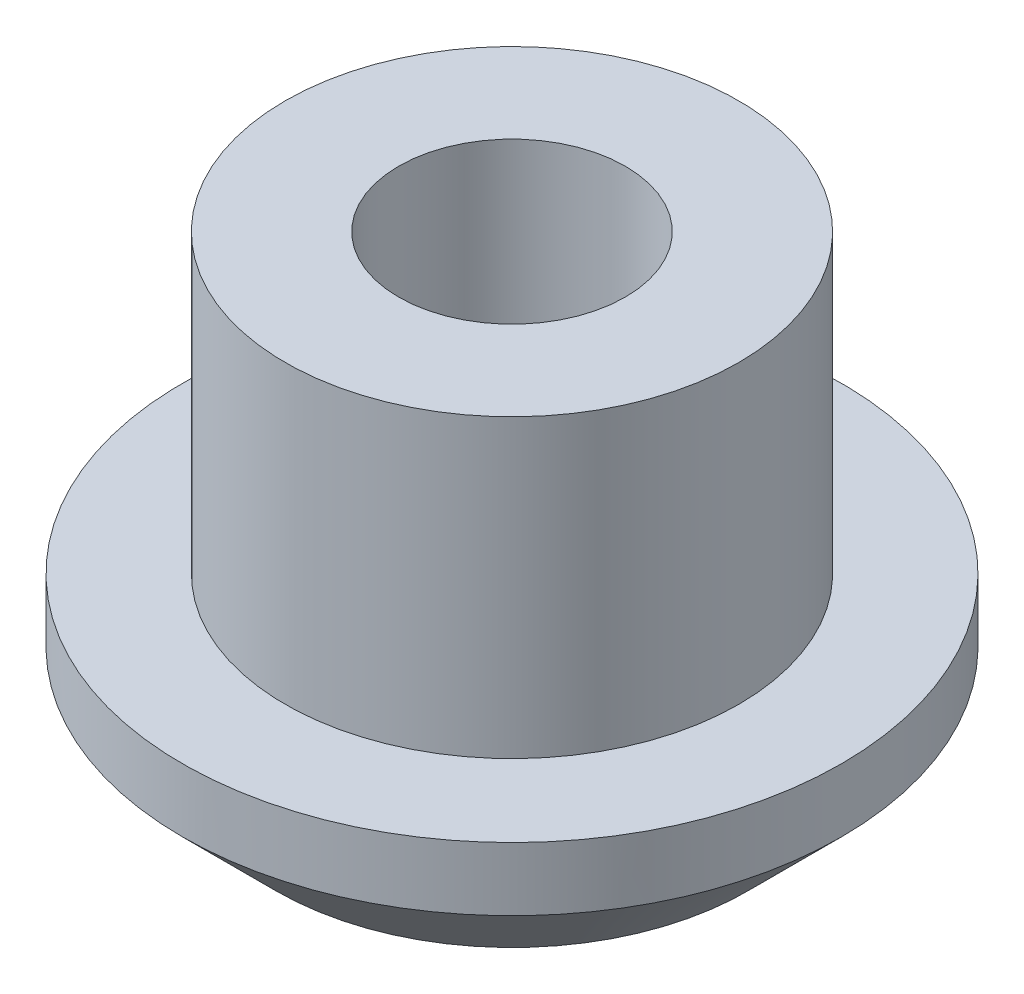
ISO-10303-21;
HEADER;
FILE_DESCRIPTION(('STEP AP214'),'2;1');
FILE_NAME('part.step','',(''),(''),'','','');
FILE_SCHEMA(('AUTOMOTIVE_DESIGN { 1 0 10303 214 1 1 1 1 }'));
ENDSEC;
DATA;
#1=APPLICATION_CONTEXT('core data for automotive mechanical design processes');
#2=APPLICATION_PROTOCOL_DEFINITION('international standard','automotive_design',2000,#1);
#3=PRODUCT_CONTEXT('',#1,'mechanical');
#4=PRODUCT('Part','Part','',(#3));
#5=PRODUCT_RELATED_PRODUCT_CATEGORY('part','',(#4));
#6=PRODUCT_DEFINITION_FORMATION('','',#4);
#7=PRODUCT_DEFINITION_CONTEXT('part definition',#1,'design');
#8=PRODUCT_DEFINITION('design','',#6,#7);
#9=PRODUCT_DEFINITION_SHAPE('','',#8);
#10=(LENGTH_UNIT() NAMED_UNIT(*) SI_UNIT(.MILLI.,.METRE.));
#11=(NAMED_UNIT(*) PLANE_ANGLE_UNIT() SI_UNIT($,.RADIAN.));
#12=(NAMED_UNIT(*) SI_UNIT($,.STERADIAN.) SOLID_ANGLE_UNIT());
#13=UNCERTAINTY_MEASURE_WITH_UNIT(LENGTH_MEASURE(1.E-05),#10,'distance_accuracy_value','');
#14=(GEOMETRIC_REPRESENTATION_CONTEXT(3) GLOBAL_UNCERTAINTY_ASSIGNED_CONTEXT((#13)) GLOBAL_UNIT_ASSIGNED_CONTEXT((#10,
#11,#12)) REPRESENTATION_CONTEXT('',''));
#15=CARTESIAN_POINT('',(0.,0.,0.));
#16=DIRECTION('',(0.,0.,1.));
#17=DIRECTION('',(1.,0.,0.));
#18=AXIS2_PLACEMENT_3D('',#15,#16,#17);
#19=CARTESIAN_POINT('',(2.25638341944507,3.95131269504348,0.));
#20=DIRECTION('',(0.,1.,0.));
#21=DIRECTION('',(0.,0.,1.));
#22=AXIS2_PLACEMENT_3D('',#19,#20,#21);
#23=CONICAL_SURFACE('',#22,13.842999998227,0.7853981625);
#24=CARTESIAN_POINT('',(2.25638341944507,3.95131269327044,0.));
#25=DIRECTION('',(0.,-1.,0.));
#26=DIRECTION('',(1.,0.,0.));
#27=AXIS2_PLACEMENT_3D('',#24,#25,#26);
#28=CIRCLE('',#27,13.843);
#29=CARTESIAN_POINT('',(16.0993834194451,3.95131269327044,0.));
#30=VERTEX_POINT('',#29);
#31=EDGE_CURVE('E39',#30,#30,#28,.F.);
#32=ORIENTED_EDGE('',*,*,#31,.F.);
#33=EDGE_LOOP('',(#32));
#34=FACE_BOUND('',#33,.T.);
#35=CARTESIAN_POINT('',(2.25638341944507,-1.7730495890933E-09,0.));
#36=DIRECTION('',(0.,1.,0.));
#37=DIRECTION('',(0.,0.,1.));
#38=AXIS2_PLACEMENT_3D('',#35,#36,#37);
#39=CIRCLE('',#38,9.89168730850263);
#40=CARTESIAN_POINT('',(2.25638341944507,-1.7730495890933E-09,9.89168730850263));
#41=VERTEX_POINT('',#40);
#42=EDGE_CURVE('E18',#41,#41,#39,.F.);
#43=ORIENTED_EDGE('',*,*,#42,.F.);
#44=EDGE_LOOP('',(#43));
#45=FACE_BOUND('',#44,.T.);
#46=ADVANCED_FACE('F15',(#34,#45),#23,.T.);
#47=CARTESIAN_POINT('',(7.20222707280986,0.,0.));
#48=DIRECTION('',(0.,-1.,0.));
#49=DIRECTION('',(0.,0.,-1.));
#50=AXIS2_PLACEMENT_3D('',#47,#48,#49);
#51=PLANE('',#50);
#52=CARTESIAN_POINT('',(2.25638341944507,0.,0.));
#53=DIRECTION('',(0.,1.,0.));
#54=DIRECTION('',(-1.,0.,0.));
#55=AXIS2_PLACEMENT_3D('',#52,#53,#54);
#56=CIRCLE('',#55,4.7625);
#57=CARTESIAN_POINT('',(-2.50611658055493,0.,0.));
#58=VERTEX_POINT('',#57);
#59=EDGE_CURVE('E37',#58,#58,#56,.T.);
#60=ORIENTED_EDGE('',*,*,#59,.T.);
#61=EDGE_LOOP('',(#60));
#62=FACE_BOUND('',#61,.T.);
#63=ORIENTED_EDGE('',*,*,#42,.T.);
#64=EDGE_LOOP('',(#63));
#65=FACE_BOUND('',#64,.T.);
#66=ADVANCED_FACE('F48',(#62,#65),#51,.T.);
#67=CARTESIAN_POINT('',(2.25638341944507,5.28226923556506,0.));
#68=DIRECTION('',(0.,-1.,0.));
#69=DIRECTION('',(1.,0.,0.));
#70=AXIS2_PLACEMENT_3D('',#67,#68,#69);
#71=CYLINDRICAL_SURFACE('',#70,13.843);
#72=CARTESIAN_POINT('',(2.25638341944507,6.61322577785969,0.));
#73=DIRECTION('',(0.,-1.,0.));
#74=DIRECTION('',(1.,0.,0.));
#75=AXIS2_PLACEMENT_3D('',#72,#73,#74);
#76=CIRCLE('',#75,13.843);
#77=CARTESIAN_POINT('',(16.0993834194451,6.61322577785969,0.));
#78=VERTEX_POINT('',#77);
#79=EDGE_CURVE('E35',#78,#78,#76,.F.);
#80=ORIENTED_EDGE('',*,*,#79,.F.);
#81=EDGE_LOOP('',(#80));
#82=FACE_BOUND('',#81,.T.);
#83=ORIENTED_EDGE('',*,*,#31,.T.);
#84=EDGE_LOOP('',(#83));
#85=FACE_BOUND('',#84,.T.);
#86=ADVANCED_FACE('F56',(#82,#85),#71,.T.);
#87=CARTESIAN_POINT('',(2.25638341944507,-24.4922977345018,0.));
#88=DIRECTION('',(0.,1.,0.));
#89=DIRECTION('',(-1.,0.,0.));
#90=AXIS2_PLACEMENT_3D('',#87,#88,#89);
#91=CYLINDRICAL_SURFACE('',#90,4.7625);
#92=CARTESIAN_POINT('',(2.25638341944507,19.05,0.));
#93=DIRECTION('',(0.,1.,0.));
#94=DIRECTION('',(-1.,0.,0.));
#95=AXIS2_PLACEMENT_3D('',#92,#93,#94);
#96=CIRCLE('',#95,4.7625);
#97=CARTESIAN_POINT('',(-2.50611658055493,19.05,0.));
#98=VERTEX_POINT('',#97);
#99=EDGE_CURVE('E27',#98,#98,#96,.F.);
#100=ORIENTED_EDGE('',*,*,#99,.F.);
#101=EDGE_LOOP('',(#100));
#102=FACE_BOUND('',#101,.T.);
#103=ORIENTED_EDGE('',*,*,#59,.F.);
#104=EDGE_LOOP('',(#103));
#105=FACE_BOUND('',#104,.T.);
#106=ADVANCED_FACE('F71',(#102,#105),#91,.F.);
#107=CARTESIAN_POINT('',(13.9403834194451,6.61322577785969,0.));
#108=DIRECTION('',(0.,1.,0.));
#109=DIRECTION('',(0.,0.,1.));
#110=AXIS2_PLACEMENT_3D('',#107,#108,#109);
#111=PLANE('',#110);
#112=CARTESIAN_POINT('',(2.25638341944507,6.61322577785969,0.));
#113=DIRECTION('',(0.,-1.,0.));
#114=DIRECTION('',(1.,0.,0.));
#115=AXIS2_PLACEMENT_3D('',#112,#113,#114);
#116=CIRCLE('',#115,9.525);
#117=CARTESIAN_POINT('',(11.7813834194451,6.61322577785969,0.));
#118=VERTEX_POINT('',#117);
#119=EDGE_CURVE('E22',#118,#118,#116,.F.);
#120=ORIENTED_EDGE('',*,*,#119,.F.);
#121=EDGE_LOOP('',(#120));
#122=FACE_BOUND('',#121,.T.);
#123=ORIENTED_EDGE('',*,*,#79,.T.);
#124=EDGE_LOOP('',(#123));
#125=FACE_BOUND('',#124,.T.);
#126=ADVANCED_FACE('F64',(#122,#125),#111,.T.);
#127=CARTESIAN_POINT('',(7.01888341944507,19.05,0.));
#128=DIRECTION('',(0.,1.,0.));
#129=DIRECTION('',(0.,0.,1.));
#130=AXIS2_PLACEMENT_3D('',#127,#128,#129);
#131=PLANE('',#130);
#132=ORIENTED_EDGE('',*,*,#99,.T.);
#133=EDGE_LOOP('',(#132));
#134=FACE_BOUND('',#133,.T.);
#135=CARTESIAN_POINT('',(2.25638341944507,19.05,0.));
#136=DIRECTION('',(0.,-1.,0.));
#137=DIRECTION('',(1.,0.,0.));
#138=AXIS2_PLACEMENT_3D('',#135,#136,#137);
#139=CIRCLE('',#138,9.525);
#140=CARTESIAN_POINT('',(11.7813834194451,19.05,0.));
#141=VERTEX_POINT('',#140);
#142=EDGE_CURVE('E10',#141,#141,#139,.T.);
#143=ORIENTED_EDGE('',*,*,#142,.F.);
#144=EDGE_LOOP('',(#143));
#145=FACE_BOUND('',#144,.T.);
#146=ADVANCED_FACE('F59',(#134,#145),#131,.T.);
#147=CARTESIAN_POINT('',(2.25638341944507,12.8316128889299,0.));
#148=DIRECTION('',(0.,-1.,0.));
#149=DIRECTION('',(1.,0.,0.));
#150=AXIS2_PLACEMENT_3D('',#147,#148,#149);
#151=CYLINDRICAL_SURFACE('',#150,9.525);
#152=ORIENTED_EDGE('',*,*,#142,.T.);
#153=EDGE_LOOP('',(#152));
#154=FACE_BOUND('',#153,.T.);
#155=ORIENTED_EDGE('',*,*,#119,.T.);
#156=EDGE_LOOP('',(#155));
#157=FACE_BOUND('',#156,.T.);
#158=ADVANCED_FACE('F57',(#154,#157),#151,.T.);
#159=CLOSED_SHELL('',(#46,#66,#86,#106,#126,#146,#158));
#160=MANIFOLD_SOLID_BREP('B1',#159);
#161=ADVANCED_BREP_SHAPE_REPRESENTATION('',(#18,#160),#14);
#162=SHAPE_DEFINITION_REPRESENTATION(#9,#161);
ENDSEC;
END-ISO-10303-21;
